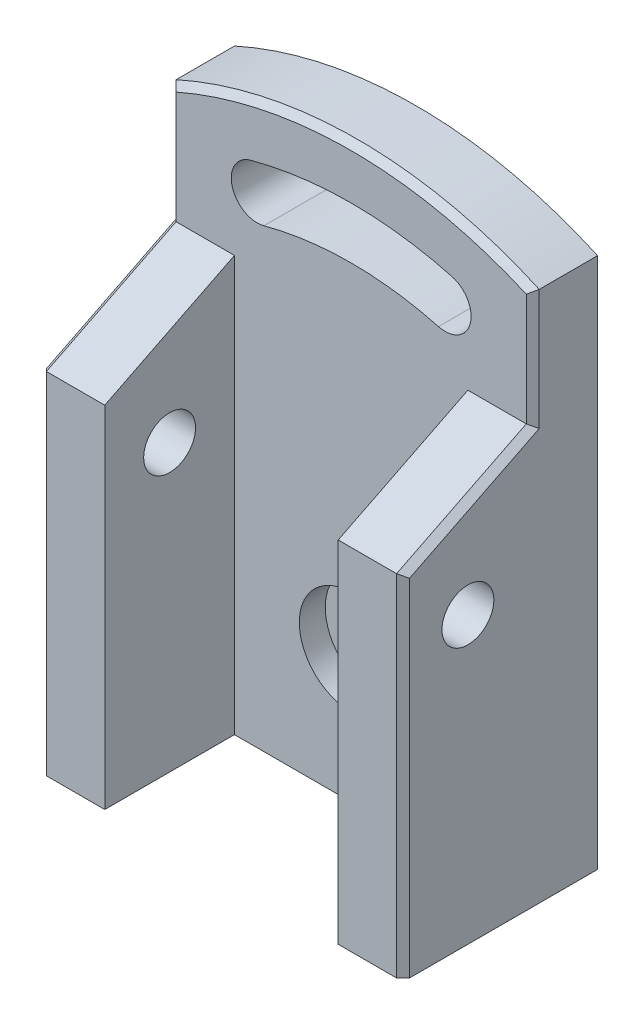
ISO-10303-21;
HEADER;
FILE_DESCRIPTION(('STEP AP214'),'2;1');
FILE_NAME('part.step','',(''),(''),'','','');
FILE_SCHEMA(('AUTOMOTIVE_DESIGN { 1 0 10303 214 1 1 1 1 }'));
ENDSEC;
DATA;
#1=APPLICATION_CONTEXT('core data for automotive mechanical design processes');
#2=APPLICATION_PROTOCOL_DEFINITION('international standard','automotive_design',2000,#1);
#3=PRODUCT_CONTEXT('',#1,'mechanical');
#4=PRODUCT('Part','Part','',(#3));
#5=PRODUCT_RELATED_PRODUCT_CATEGORY('part','',(#4));
#6=PRODUCT_DEFINITION_FORMATION('','',#4);
#7=PRODUCT_DEFINITION_CONTEXT('part definition',#1,'design');
#8=PRODUCT_DEFINITION('design','',#6,#7);
#9=PRODUCT_DEFINITION_SHAPE('','',#8);
#10=(LENGTH_UNIT() NAMED_UNIT(*) SI_UNIT(.MILLI.,.METRE.));
#11=(NAMED_UNIT(*) PLANE_ANGLE_UNIT() SI_UNIT($,.RADIAN.));
#12=(NAMED_UNIT(*) SI_UNIT($,.STERADIAN.) SOLID_ANGLE_UNIT());
#13=UNCERTAINTY_MEASURE_WITH_UNIT(LENGTH_MEASURE(1.E-05),#10,'distance_accuracy_value','');
#14=(GEOMETRIC_REPRESENTATION_CONTEXT(3) GLOBAL_UNCERTAINTY_ASSIGNED_CONTEXT((#13)) GLOBAL_UNIT_ASSIGNED_CONTEXT((#10,
#11,#12)) REPRESENTATION_CONTEXT('',''));
#15=CARTESIAN_POINT('',(0.,0.,0.));
#16=DIRECTION('',(0.,0.,1.));
#17=DIRECTION('',(1.,0.,0.));
#18=AXIS2_PLACEMENT_3D('',#15,#16,#17);
#19=CARTESIAN_POINT('',(0.,0.,0.));
#20=DIRECTION('',(0.,0.,1.));
#21=DIRECTION('',(1.,0.,0.));
#22=AXIS2_PLACEMENT_3D('',#19,#20,#21);
#23=PLANE('',#22);
#24=CARTESIAN_POINT('',(0.,20.,0.));
#25=DIRECTION('',(0.,0.,1.));
#26=DIRECTION('',(1.,0.,0.));
#27=AXIS2_PLACEMENT_3D('',#24,#25,#26);
#28=CIRCLE('',#27,8.00000000000001);
#29=CARTESIAN_POINT('',(8.00000000000001,20.,0.));
#30=VERTEX_POINT('',#29);
#31=EDGE_CURVE('E229',#30,#30,#28,.T.);
#32=ORIENTED_EDGE('',*,*,#31,.F.);
#33=EDGE_LOOP('',(#32));
#34=FACE_BOUND('',#33,.T.);
#35=CARTESIAN_POINT('',(-14.4938665257408,74.0918462721879,0.));
#36=DIRECTION('',(0.,0.,1.));
#37=DIRECTION('',(1.,0.,0.));
#38=AXIS2_PLACEMENT_3D('',#35,#36,#37);
#39=CIRCLE('',#38,3.99999999999999);
#40=CARTESIAN_POINT('',(-15.5291427061509,77.9555495773442,0.));
#41=VERTEX_POINT('',#40);
#42=CARTESIAN_POINT('',(-13.4585903453308,70.2281429670317,0.));
#43=VERTEX_POINT('',#42);
#44=EDGE_CURVE('E258',#41,#43,#39,.T.);
#45=ORIENTED_EDGE('',*,*,#44,.F.);
#46=CARTESIAN_POINT('',(0.,20.,0.));
#47=DIRECTION('',(0.,0.,1.));
#48=DIRECTION('',(1.,0.,0.));
#49=AXIS2_PLACEMENT_3D('',#46,#47,#48);
#50=CIRCLE('',#49,60.);
#51=CARTESIAN_POINT('',(15.5291427061509,77.9555495773442,0.));
#52=VERTEX_POINT('',#51);
#53=EDGE_CURVE('E261',#52,#41,#50,.T.);
#54=ORIENTED_EDGE('',*,*,#53,.F.);
#55=CARTESIAN_POINT('',(14.4938665257408,74.0918462721879,0.));
#56=DIRECTION('',(0.,0.,1.));
#57=DIRECTION('',(1.,0.,0.));
#58=AXIS2_PLACEMENT_3D('',#55,#56,#57);
#59=CIRCLE('',#58,3.99999999999999);
#60=CARTESIAN_POINT('',(13.4585903453308,70.2281429670316,0.));
#61=VERTEX_POINT('',#60);
#62=EDGE_CURVE('E263',#61,#52,#59,.T.);
#63=ORIENTED_EDGE('',*,*,#62,.F.);
#64=CARTESIAN_POINT('',(0.,20.,0.));
#65=DIRECTION('',(0.,0.,1.));
#66=DIRECTION('',(1.,0.,0.));
#67=AXIS2_PLACEMENT_3D('',#64,#65,#66);
#68=CIRCLE('',#67,52.);
#69=EDGE_CURVE('E240',#61,#43,#68,.T.);
#70=ORIENTED_EDGE('',*,*,#69,.T.);
#71=EDGE_LOOP('',(#45,#54,#63,#70));
#72=FACE_BOUND('',#71,.T.);
#73=DIRECTION('',(1.,0.,0.));
#74=VECTOR('',#73,1.);
#75=CARTESIAN_POINT('',(18.,64.,0.));
#76=LINE('',#75,#74);
#77=CARTESIAN_POINT('',(18.,64.,0.));
#78=VERTEX_POINT('',#77);
#79=CARTESIAN_POINT('',(27.,64.,0.));
#80=VERTEX_POINT('',#79);
#81=EDGE_CURVE('E174',#78,#80,#76,.T.);
#82=ORIENTED_EDGE('',*,*,#81,.T.);
#83=DIRECTION('',(0.,1.,0.));
#84=VECTOR('',#83,1.);
#85=CARTESIAN_POINT('',(27.,81.9677335393187,0.));
#86=LINE('',#85,#84);
#87=CARTESIAN_POINT('',(27.,81.3188388670236,0.));
#88=VERTEX_POINT('',#87);
#89=EDGE_CURVE('E306',#80,#88,#86,.T.);
#90=ORIENTED_EDGE('',*,*,#89,.T.);
#91=CARTESIAN_POINT('',(0.,20.,0.));
#92=DIRECTION('',(0.,0.,1.));
#93=DIRECTION('',(1.,0.,0.));
#94=AXIS2_PLACEMENT_3D('',#91,#92,#93);
#95=CIRCLE('',#94,67.);
#96=CARTESIAN_POINT('',(-27.,81.3188388670236,0.));
#97=VERTEX_POINT('',#96);
#98=EDGE_CURVE('E304',#88,#97,#95,.T.);
#99=ORIENTED_EDGE('',*,*,#98,.T.);
#100=DIRECTION('',(0.,-1.,0.));
#101=VECTOR('',#100,1.);
#102=CARTESIAN_POINT('',(-27.,64.,0.));
#103=LINE('',#102,#101);
#104=CARTESIAN_POINT('',(-27.,64.,0.));
#105=VERTEX_POINT('',#104);
#106=EDGE_CURVE('E302',#97,#105,#103,.T.);
#107=ORIENTED_EDGE('',*,*,#106,.T.);
#108=DIRECTION('',(-1.,0.,0.));
#109=VECTOR('',#108,1.);
#110=CARTESIAN_POINT('',(-18.,64.,0.));
#111=LINE('',#110,#109);
#112=CARTESIAN_POINT('',(-18.,64.,0.));
#113=VERTEX_POINT('',#112);
#114=EDGE_CURVE('E219',#113,#105,#111,.T.);
#115=ORIENTED_EDGE('',*,*,#114,.F.);
#116=DIRECTION('',(0.,1.,0.));
#117=VECTOR('',#116,1.);
#118=CARTESIAN_POINT('',(-18.,0.,0.));
#119=LINE('',#118,#117);
#120=CARTESIAN_POINT('',(-18.,0.,0.));
#121=VERTEX_POINT('',#120);
#122=EDGE_CURVE('E204',#121,#113,#119,.T.);
#123=ORIENTED_EDGE('',*,*,#122,.F.);
#124=DIRECTION('',(1.,0.,0.));
#125=VECTOR('',#124,1.);
#126=CARTESIAN_POINT('',(0.,0.,0.));
#127=LINE('',#126,#125);
#128=CARTESIAN_POINT('',(18.,0.,0.));
#129=VERTEX_POINT('',#128);
#130=EDGE_CURVE('E233',#121,#129,#127,.T.);
#131=ORIENTED_EDGE('',*,*,#130,.T.);
#132=DIRECTION('',(0.,-1.,0.));
#133=VECTOR('',#132,1.);
#134=CARTESIAN_POINT('',(18.,0.,0.));
#135=LINE('',#134,#133);
#136=EDGE_CURVE('E188',#78,#129,#135,.T.);
#137=ORIENTED_EDGE('',*,*,#136,.F.);
#138=EDGE_LOOP('',(#82,#90,#99,#107,#115,#123,#131,#137));
#139=FACE_BOUND('',#138,.T.);
#140=ADVANCED_FACE('F35',(#34,#72,#139),#23,.T.);
#141=CARTESIAN_POINT('',(-14.4938665257408,74.0918462721879,-10.));
#142=DIRECTION('',(0.,0.,1.));
#143=DIRECTION('',(1.,0.,0.));
#144=AXIS2_PLACEMENT_3D('',#141,#142,#143);
#145=CYLINDRICAL_SURFACE('',#144,3.99999999999999);
#146=ORIENTED_EDGE('',*,*,#44,.T.);
#147=DIRECTION('',(0.,0.,1.));
#148=VECTOR('',#147,1.);
#149=CARTESIAN_POINT('',(-13.4585903453308,70.2281429670317,-10.));
#150=LINE('',#149,#148);
#151=CARTESIAN_POINT('',(-13.4585903453308,70.2281429670317,-10.));
#152=VERTEX_POINT('',#151);
#153=EDGE_CURVE('E267',#152,#43,#150,.T.);
#154=ORIENTED_EDGE('',*,*,#153,.F.);
#155=CARTESIAN_POINT('',(-14.4938665257408,74.0918462721879,-10.));
#156=DIRECTION('',(0.,0.,1.));
#157=DIRECTION('',(1.,0.,0.));
#158=AXIS2_PLACEMENT_3D('',#155,#156,#157);
#159=CIRCLE('',#158,3.99999999999999);
#160=CARTESIAN_POINT('',(-15.5291427061509,77.9555495773442,-10.));
#161=VERTEX_POINT('',#160);
#162=EDGE_CURVE('E247',#161,#152,#159,.T.);
#163=ORIENTED_EDGE('',*,*,#162,.F.);
#164=DIRECTION('',(0.,0.,1.));
#165=VECTOR('',#164,1.);
#166=CARTESIAN_POINT('',(-15.5291427061509,77.9555495773442,-10.));
#167=LINE('',#166,#165);
#168=EDGE_CURVE('E275',#161,#41,#167,.T.);
#169=ORIENTED_EDGE('',*,*,#168,.T.);
#170=EDGE_LOOP('',(#146,#154,#163,#169));
#171=FACE_BOUND('',#170,.T.);
#172=ADVANCED_FACE('F357',(#171),#145,.F.);
#173=CARTESIAN_POINT('',(0.,20.,-10.));
#174=DIRECTION('',(0.,0.,1.));
#175=DIRECTION('',(1.,0.,0.));
#176=AXIS2_PLACEMENT_3D('',#173,#174,#175);
#177=CYLINDRICAL_SURFACE('',#176,52.);
#178=ORIENTED_EDGE('',*,*,#69,.F.);
#179=DIRECTION('',(0.,0.,1.));
#180=VECTOR('',#179,1.);
#181=CARTESIAN_POINT('',(13.4585903453308,70.2281429670316,-10.));
#182=LINE('',#181,#180);
#183=CARTESIAN_POINT('',(13.4585903453308,70.2281429670316,-10.));
#184=VERTEX_POINT('',#183);
#185=EDGE_CURVE('E270',#184,#61,#182,.T.);
#186=ORIENTED_EDGE('',*,*,#185,.F.);
#187=CARTESIAN_POINT('',(0.,20.,-10.));
#188=DIRECTION('',(0.,0.,1.));
#189=DIRECTION('',(1.,0.,0.));
#190=AXIS2_PLACEMENT_3D('',#187,#188,#189);
#191=CIRCLE('',#190,52.);
#192=EDGE_CURVE('E253',#184,#152,#191,.T.);
#193=ORIENTED_EDGE('',*,*,#192,.T.);
#194=ORIENTED_EDGE('',*,*,#153,.T.);
#195=EDGE_LOOP('',(#178,#186,#193,#194));
#196=FACE_BOUND('',#195,.T.);
#197=ADVANCED_FACE('F363',(#196),#177,.T.);
#198=CARTESIAN_POINT('',(14.4938665257408,74.0918462721879,-10.));
#199=DIRECTION('',(0.,0.,1.));
#200=DIRECTION('',(1.,0.,0.));
#201=AXIS2_PLACEMENT_3D('',#198,#199,#200);
#202=CYLINDRICAL_SURFACE('',#201,3.99999999999999);
#203=ORIENTED_EDGE('',*,*,#62,.T.);
#204=DIRECTION('',(0.,0.,1.));
#205=VECTOR('',#204,1.);
#206=CARTESIAN_POINT('',(15.5291427061509,77.9555495773442,-10.));
#207=LINE('',#206,#205);
#208=CARTESIAN_POINT('',(15.5291427061509,77.9555495773442,-10.));
#209=VERTEX_POINT('',#208);
#210=EDGE_CURVE('E272',#209,#52,#207,.T.);
#211=ORIENTED_EDGE('',*,*,#210,.F.);
#212=CARTESIAN_POINT('',(14.4938665257408,74.0918462721879,-10.));
#213=DIRECTION('',(0.,0.,1.));
#214=DIRECTION('',(1.,0.,0.));
#215=AXIS2_PLACEMENT_3D('',#212,#213,#214);
#216=CIRCLE('',#215,3.99999999999999);
#217=EDGE_CURVE('E251',#184,#209,#216,.T.);
#218=ORIENTED_EDGE('',*,*,#217,.F.);
#219=ORIENTED_EDGE('',*,*,#185,.T.);
#220=EDGE_LOOP('',(#203,#211,#218,#219));
#221=FACE_BOUND('',#220,.T.);
#222=ADVANCED_FACE('F374',(#221),#202,.F.);
#223=CARTESIAN_POINT('',(0.,20.,-10.));
#224=DIRECTION('',(0.,0.,1.));
#225=DIRECTION('',(1.,0.,0.));
#226=AXIS2_PLACEMENT_3D('',#223,#224,#225);
#227=CYLINDRICAL_SURFACE('',#226,68.);
#228=DIRECTION('',(0.,0.,1.));
#229=VECTOR('',#228,1.);
#230=CARTESIAN_POINT('',(-28.,81.9677335393187,-10.));
#231=LINE('',#230,#229);
#232=CARTESIAN_POINT('',(-28.,81.9677335393187,-10.));
#233=VERTEX_POINT('',#232);
#234=CARTESIAN_POINT('',(-28.,81.9677335393187,-1.00000000000001));
#235=VERTEX_POINT('',#234);
#236=EDGE_CURVE('E256',#233,#235,#231,.T.);
#237=ORIENTED_EDGE('',*,*,#236,.T.);
#238=CARTESIAN_POINT('',(0.,20.,-1.00000000000001));
#239=DIRECTION('',(0.,0.,1.));
#240=DIRECTION('',(1.,0.,0.));
#241=AXIS2_PLACEMENT_3D('',#238,#239,#240);
#242=CIRCLE('',#241,68.);
#243=CARTESIAN_POINT('',(28.,81.9677335393187,-1.00000000000001));
#244=VERTEX_POINT('',#243);
#245=EDGE_CURVE('E308',#235,#244,#242,.F.);
#246=ORIENTED_EDGE('',*,*,#245,.T.);
#247=DIRECTION('',(0.,0.,1.));
#248=VECTOR('',#247,1.);
#249=CARTESIAN_POINT('',(28.,81.9677335393187,-10.));
#250=LINE('',#249,#248);
#251=CARTESIAN_POINT('',(28.,81.9677335393187,-10.));
#252=VERTEX_POINT('',#251);
#253=EDGE_CURVE('E278',#252,#244,#250,.T.);
#254=ORIENTED_EDGE('',*,*,#253,.F.);
#255=CARTESIAN_POINT('',(0.,20.,-10.));
#256=DIRECTION('',(0.,0.,1.));
#257=DIRECTION('',(1.,0.,0.));
#258=AXIS2_PLACEMENT_3D('',#255,#256,#257);
#259=CIRCLE('',#258,68.);
#260=EDGE_CURVE('E236',#233,#252,#259,.F.);
#261=ORIENTED_EDGE('',*,*,#260,.F.);
#262=EDGE_LOOP('',(#237,#246,#254,#261));
#263=FACE_BOUND('',#262,.T.);
#264=ADVANCED_FACE('F378',(#263),#227,.T.);
#265=CARTESIAN_POINT('',(28.,0.,-10.));
#266=DIRECTION('',(-1.,0.,0.));
#267=DIRECTION('',(0.,-1.,0.));
#268=AXIS2_PLACEMENT_3D('',#265,#266,#267);
#269=PLANE('',#268);
#270=DIRECTION('',(0.,-0.447213595499958,0.894427190999916));
#271=VECTOR('',#270,1.);
#272=CARTESIAN_POINT('',(28.,54.3055728090001,17.1527864045));
#273=LINE('',#272,#271);
#274=CARTESIAN_POINT('',(28.,63.3819660112501,-1.00000000000001));
#275=VERTEX_POINT('',#274);
#276=CARTESIAN_POINT('',(28.,53.3819660112501,19.));
#277=VERTEX_POINT('',#276);
#278=EDGE_CURVE('E293',#275,#277,#273,.T.);
#279=ORIENTED_EDGE('',*,*,#278,.T.);
#280=DIRECTION('',(0.,-1.,0.));
#281=VECTOR('',#280,1.);
#282=CARTESIAN_POINT('',(28.,0.,19.));
#283=LINE('',#282,#281);
#284=CARTESIAN_POINT('',(28.,0.,19.));
#285=VERTEX_POINT('',#284);
#286=EDGE_CURVE('E295',#277,#285,#283,.T.);
#287=ORIENTED_EDGE('',*,*,#286,.T.);
#288=DIRECTION('',(0.,0.,1.));
#289=VECTOR('',#288,1.);
#290=CARTESIAN_POINT('',(28.,0.,-10.));
#291=LINE('',#290,#289);
#292=CARTESIAN_POINT('',(28.,0.,-10.));
#293=VERTEX_POINT('',#292);
#294=EDGE_CURVE('E281',#293,#285,#291,.T.);
#295=ORIENTED_EDGE('',*,*,#294,.F.);
#296=DIRECTION('',(0.,-1.,0.));
#297=VECTOR('',#296,1.);
#298=CARTESIAN_POINT('',(28.,0.,-10.));
#299=LINE('',#298,#297);
#300=EDGE_CURVE('E245',#252,#293,#299,.T.);
#301=ORIENTED_EDGE('',*,*,#300,.F.);
#302=ORIENTED_EDGE('',*,*,#253,.T.);
#303=DIRECTION('',(0.,-1.,0.));
#304=VECTOR('',#303,1.);
#305=CARTESIAN_POINT('',(28.,64.,-1.00000000000001));
#306=LINE('',#305,#304);
#307=EDGE_CURVE('E291',#244,#275,#306,.T.);
#308=ORIENTED_EDGE('',*,*,#307,.T.);
#309=EDGE_LOOP('',(#279,#287,#295,#301,#302,#308));
#310=FACE_BOUND('',#309,.T.);
#311=CARTESIAN_POINT('',(28.,44.,10.));
#312=DIRECTION('',(1.,0.,0.));
#313=DIRECTION('',(0.,1.,0.));
#314=AXIS2_PLACEMENT_3D('',#311,#312,#313);
#315=CIRCLE('',#314,4.);
#316=CARTESIAN_POINT('',(28.,48.,10.));
#317=VERTEX_POINT('',#316);
#318=EDGE_CURVE('E194',#317,#317,#315,.T.);
#319=ORIENTED_EDGE('',*,*,#318,.F.);
#320=EDGE_LOOP('',(#319));
#321=FACE_BOUND('',#320,.T.);
#322=ADVANCED_FACE('F385',(#310,#321),#269,.F.);
#323=CARTESIAN_POINT('',(0.,0.,-10.));
#324=DIRECTION('',(0.,-1.,0.));
#325=DIRECTION('',(1.,0.,0.));
#326=AXIS2_PLACEMENT_3D('',#323,#324,#325);
#327=PLANE('',#326);
#328=ORIENTED_EDGE('',*,*,#294,.T.);
#329=DIRECTION('',(0.707106781186548,0.,-0.707106781186548));
#330=VECTOR('',#329,1.);
#331=CARTESIAN_POINT('',(28.5,0.,18.5));
#332=LINE('',#331,#330);
#333=CARTESIAN_POINT('',(27.,0.,20.));
#334=VERTEX_POINT('',#333);
#335=EDGE_CURVE('E170',#285,#334,#332,.F.);
#336=ORIENTED_EDGE('',*,*,#335,.T.);
#337=DIRECTION('',(1.,0.,0.));
#338=VECTOR('',#337,1.);
#339=CARTESIAN_POINT('',(18.,0.,20.));
#340=LINE('',#339,#338);
#341=CARTESIAN_POINT('',(18.,0.,20.));
#342=VERTEX_POINT('',#341);
#343=EDGE_CURVE('E161',#342,#334,#340,.T.);
#344=ORIENTED_EDGE('',*,*,#343,.F.);
#345=DIRECTION('',(0.,0.,-1.));
#346=VECTOR('',#345,1.);
#347=CARTESIAN_POINT('',(18.,0.,0.));
#348=LINE('',#347,#346);
#349=EDGE_CURVE('E167',#342,#129,#348,.T.);
#350=ORIENTED_EDGE('',*,*,#349,.T.);
#351=ORIENTED_EDGE('',*,*,#130,.F.);
#352=DIRECTION('',(0.,0.,1.));
#353=VECTOR('',#352,1.);
#354=CARTESIAN_POINT('',(-18.,0.,0.));
#355=LINE('',#354,#353);
#356=CARTESIAN_POINT('',(-18.,0.,20.));
#357=VERTEX_POINT('',#356);
#358=EDGE_CURVE('E207',#121,#357,#355,.T.);
#359=ORIENTED_EDGE('',*,*,#358,.T.);
#360=DIRECTION('',(-1.,0.,0.));
#361=VECTOR('',#360,1.);
#362=CARTESIAN_POINT('',(-18.,0.,20.));
#363=LINE('',#362,#361);
#364=CARTESIAN_POINT('',(-27.,0.,20.));
#365=VERTEX_POINT('',#364);
#366=EDGE_CURVE('E216',#357,#365,#363,.T.);
#367=ORIENTED_EDGE('',*,*,#366,.T.);
#368=DIRECTION('',(-0.707106781186548,0.,-0.707106781186548));
#369=VECTOR('',#368,1.);
#370=CARTESIAN_POINT('',(-28.5,0.,18.5));
#371=LINE('',#370,#369);
#372=CARTESIAN_POINT('',(-28.,0.,19.));
#373=VERTEX_POINT('',#372);
#374=EDGE_CURVE('E297',#365,#373,#371,.T.);
#375=ORIENTED_EDGE('',*,*,#374,.T.);
#376=DIRECTION('',(0.,0.,1.));
#377=VECTOR('',#376,1.);
#378=CARTESIAN_POINT('',(-28.,0.,-10.));
#379=LINE('',#378,#377);
#380=CARTESIAN_POINT('',(-28.,0.,-10.));
#381=VERTEX_POINT('',#380);
#382=EDGE_CURVE('E283',#381,#373,#379,.T.);
#383=ORIENTED_EDGE('',*,*,#382,.F.);
#384=DIRECTION('',(1.,0.,0.));
#385=VECTOR('',#384,1.);
#386=CARTESIAN_POINT('',(0.,0.,-10.));
#387=LINE('',#386,#385);
#388=EDGE_CURVE('E242',#381,#293,#387,.T.);
#389=ORIENTED_EDGE('',*,*,#388,.T.);
#390=EDGE_LOOP('',(#328,#336,#344,#350,#351,#359,#367,#375,#383,#389));
#391=FACE_BOUND('',#390,.T.);
#392=ADVANCED_FACE('F164',(#391),#327,.T.);
#393=CARTESIAN_POINT('',(-28.,0.,-10.));
#394=DIRECTION('',(1.,0.,0.));
#395=DIRECTION('',(0.,1.,0.));
#396=AXIS2_PLACEMENT_3D('',#393,#394,#395);
#397=PLANE('',#396);
#398=DIRECTION('',(0.,0.447213595499958,-0.894427190999916));
#399=VECTOR('',#398,1.);
#400=CARTESIAN_POINT('',(-28.,63.1055728090001,-0.447213595499967));
#401=LINE('',#400,#399);
#402=CARTESIAN_POINT('',(-28.,53.3819660112501,19.));
#403=VERTEX_POINT('',#402);
#404=CARTESIAN_POINT('',(-28.,63.3819660112501,-1.00000000000001));
#405=VERTEX_POINT('',#404);
#406=EDGE_CURVE('E59',#403,#405,#401,.T.);
#407=ORIENTED_EDGE('',*,*,#406,.T.);
#408=DIRECTION('',(0.,1.,0.));
#409=VECTOR('',#408,1.);
#410=CARTESIAN_POINT('',(-28.,81.9677335393187,-1.00000000000001));
#411=LINE('',#410,#409);
#412=EDGE_CURVE('E313',#405,#235,#411,.T.);
#413=ORIENTED_EDGE('',*,*,#412,.T.);
#414=ORIENTED_EDGE('',*,*,#236,.F.);
#415=DIRECTION('',(0.,1.,0.));
#416=VECTOR('',#415,1.);
#417=CARTESIAN_POINT('',(-28.,0.,-10.));
#418=LINE('',#417,#416);
#419=EDGE_CURVE('E239',#381,#233,#418,.T.);
#420=ORIENTED_EDGE('',*,*,#419,.F.);
#421=ORIENTED_EDGE('',*,*,#382,.T.);
#422=DIRECTION('',(0.,1.,0.));
#423=VECTOR('',#422,1.);
#424=CARTESIAN_POINT('',(-28.,54.,19.));
#425=LINE('',#424,#423);
#426=EDGE_CURVE('E310',#373,#403,#425,.T.);
#427=ORIENTED_EDGE('',*,*,#426,.T.);
#428=EDGE_LOOP('',(#407,#413,#414,#420,#421,#427));
#429=FACE_BOUND('',#428,.T.);
#430=CARTESIAN_POINT('',(-28.,44.,10.));
#431=DIRECTION('',(-1.,0.,0.));
#432=DIRECTION('',(0.,-1.,0.));
#433=AXIS2_PLACEMENT_3D('',#430,#431,#432);
#434=CIRCLE('',#433,4.);
#435=CARTESIAN_POINT('',(-28.,40.,10.));
#436=VERTEX_POINT('',#435);
#437=EDGE_CURVE('E198',#436,#436,#434,.T.);
#438=ORIENTED_EDGE('',*,*,#437,.F.);
#439=EDGE_LOOP('',(#438));
#440=FACE_BOUND('',#439,.T.);
#441=ADVANCED_FACE('F382',(#429,#440),#397,.F.);
#442=CARTESIAN_POINT('',(0.,20.,-10.));
#443=DIRECTION('',(0.,0.,1.));
#444=DIRECTION('',(1.,0.,0.));
#445=AXIS2_PLACEMENT_3D('',#442,#443,#444);
#446=CYLINDRICAL_SURFACE('',#445,60.);
#447=ORIENTED_EDGE('',*,*,#53,.T.);
#448=ORIENTED_EDGE('',*,*,#168,.F.);
#449=CARTESIAN_POINT('',(0.,20.,-10.));
#450=DIRECTION('',(0.,0.,1.));
#451=DIRECTION('',(1.,0.,0.));
#452=AXIS2_PLACEMENT_3D('',#449,#450,#451);
#453=CIRCLE('',#452,60.);
#454=EDGE_CURVE('E249',#209,#161,#453,.T.);
#455=ORIENTED_EDGE('',*,*,#454,.F.);
#456=ORIENTED_EDGE('',*,*,#210,.T.);
#457=EDGE_LOOP('',(#447,#448,#455,#456));
#458=FACE_BOUND('',#457,.T.);
#459=ADVANCED_FACE('F380',(#458),#446,.F.);
#460=CARTESIAN_POINT('',(0.,0.,-10.));
#461=DIRECTION('',(0.,0.,1.));
#462=DIRECTION('',(1.,0.,0.));
#463=AXIS2_PLACEMENT_3D('',#460,#461,#462);
#464=PLANE('',#463);
#465=CARTESIAN_POINT('',(0.,20.,-10.));
#466=DIRECTION('',(0.,0.,1.));
#467=DIRECTION('',(1.,0.,0.));
#468=AXIS2_PLACEMENT_3D('',#465,#466,#467);
#469=CIRCLE('',#468,4.00000000000001);
#470=CARTESIAN_POINT('',(4.00000000000001,20.,-10.));
#471=VERTEX_POINT('',#470);
#472=EDGE_CURVE('E226',#471,#471,#469,.T.);
#473=ORIENTED_EDGE('',*,*,#472,.T.);
#474=EDGE_LOOP('',(#473));
#475=FACE_BOUND('',#474,.T.);
#476=ORIENTED_EDGE('',*,*,#260,.T.);
#477=ORIENTED_EDGE('',*,*,#300,.T.);
#478=ORIENTED_EDGE('',*,*,#388,.F.);
#479=ORIENTED_EDGE('',*,*,#419,.T.);
#480=EDGE_LOOP('',(#476,#477,#478,#479));
#481=FACE_BOUND('',#480,.T.);
#482=ORIENTED_EDGE('',*,*,#162,.T.);
#483=ORIENTED_EDGE('',*,*,#192,.F.);
#484=ORIENTED_EDGE('',*,*,#217,.T.);
#485=ORIENTED_EDGE('',*,*,#454,.T.);
#486=EDGE_LOOP('',(#482,#483,#484,#485));
#487=FACE_BOUND('',#486,.T.);
#488=ADVANCED_FACE('F370',(#475,#481,#487),#464,.F.);
#489=CARTESIAN_POINT('',(0.,20.,-4.));
#490=DIRECTION('',(0.,0.,1.));
#491=DIRECTION('',(1.,0.,0.));
#492=AXIS2_PLACEMENT_3D('',#489,#490,#491);
#493=CYLINDRICAL_SURFACE('',#492,8.00000000000001);
#494=CARTESIAN_POINT('',(0.,20.,-4.));
#495=DIRECTION('',(0.,0.,1.));
#496=DIRECTION('',(1.,0.,0.));
#497=AXIS2_PLACEMENT_3D('',#494,#495,#496);
#498=CIRCLE('',#497,8.00000000000001);
#499=CARTESIAN_POINT('',(8.00000000000001,20.,-4.));
#500=VERTEX_POINT('',#499);
#501=EDGE_CURVE('E230',#500,#500,#498,.T.);
#502=ORIENTED_EDGE('',*,*,#501,.F.);
#503=EDGE_LOOP('',(#502));
#504=FACE_BOUND('',#503,.T.);
#505=ORIENTED_EDGE('',*,*,#31,.T.);
#506=EDGE_LOOP('',(#505));
#507=FACE_BOUND('',#506,.T.);
#508=ADVANCED_FACE('F452',(#504,#507),#493,.F.);
#509=CARTESIAN_POINT('',(0.,20.,-4.));
#510=DIRECTION('',(0.,0.,1.));
#511=DIRECTION('',(1.,0.,0.));
#512=AXIS2_PLACEMENT_3D('',#509,#510,#511);
#513=PLANE('',#512);
#514=CARTESIAN_POINT('',(0.,20.,-4.));
#515=DIRECTION('',(0.,0.,1.));
#516=DIRECTION('',(1.,0.,0.));
#517=AXIS2_PLACEMENT_3D('',#514,#515,#516);
#518=CIRCLE('',#517,4.00000000000001);
#519=CARTESIAN_POINT('',(4.00000000000001,20.,-4.));
#520=VERTEX_POINT('',#519);
#521=EDGE_CURVE('E221',#520,#520,#518,.T.);
#522=ORIENTED_EDGE('',*,*,#521,.F.);
#523=EDGE_LOOP('',(#522));
#524=FACE_BOUND('',#523,.T.);
#525=ORIENTED_EDGE('',*,*,#501,.T.);
#526=EDGE_LOOP('',(#525));
#527=FACE_BOUND('',#526,.T.);
#528=ADVANCED_FACE('F442',(#524,#527),#513,.T.);
#529=CARTESIAN_POINT('',(0.,20.,-24.));
#530=DIRECTION('',(0.,0.,1.));
#531=DIRECTION('',(1.,0.,0.));
#532=AXIS2_PLACEMENT_3D('',#529,#530,#531);
#533=CYLINDRICAL_SURFACE('',#532,4.00000000000001);
#534=ORIENTED_EDGE('',*,*,#521,.T.);
#535=EDGE_LOOP('',(#534));
#536=FACE_BOUND('',#535,.T.);
#537=ORIENTED_EDGE('',*,*,#472,.F.);
#538=EDGE_LOOP('',(#537));
#539=FACE_BOUND('',#538,.T.);
#540=ADVANCED_FACE('F434',(#536,#539),#533,.F.);
#541=CARTESIAN_POINT('',(-18.,51.2,25.6));
#542=DIRECTION('',(0.,0.894427190999916,0.447213595499958));
#543=DIRECTION('',(0.,-0.447213595499958,0.894427190999916));
#544=AXIS2_PLACEMENT_3D('',#541,#542,#543);
#545=PLANE('',#544);
#546=ORIENTED_EDGE('',*,*,#114,.T.);
#547=DIRECTION('',(0.,-0.447213595499958,0.894427190999916));
#548=VECTOR('',#547,1.);
#549=CARTESIAN_POINT('',(-27.,54.,20.));
#550=LINE('',#549,#548);
#551=CARTESIAN_POINT('',(-27.,54.,20.));
#552=VERTEX_POINT('',#551);
#553=EDGE_CURVE('E44',#105,#552,#550,.T.);
#554=ORIENTED_EDGE('',*,*,#553,.T.);
#555=DIRECTION('',(-1.,0.,0.));
#556=VECTOR('',#555,1.);
#557=CARTESIAN_POINT('',(-18.,54.,20.));
#558=LINE('',#557,#556);
#559=CARTESIAN_POINT('',(-18.,54.,20.));
#560=VERTEX_POINT('',#559);
#561=EDGE_CURVE('E222',#560,#552,#558,.T.);
#562=ORIENTED_EDGE('',*,*,#561,.F.);
#563=DIRECTION('',(0.,0.447213595499958,-0.894427190999916));
#564=VECTOR('',#563,1.);
#565=CARTESIAN_POINT('',(-18.,51.2,25.6));
#566=LINE('',#565,#564);
#567=EDGE_CURVE('E213',#560,#113,#566,.T.);
#568=ORIENTED_EDGE('',*,*,#567,.T.);
#569=EDGE_LOOP('',(#546,#554,#562,#568));
#570=FACE_BOUND('',#569,.T.);
#571=ADVANCED_FACE('F432',(#570),#545,.T.);
#572=CARTESIAN_POINT('',(-18.,0.,20.));
#573=DIRECTION('',(0.,0.,1.));
#574=DIRECTION('',(1.,0.,0.));
#575=AXIS2_PLACEMENT_3D('',#572,#573,#574);
#576=PLANE('',#575);
#577=ORIENTED_EDGE('',*,*,#561,.T.);
#578=DIRECTION('',(0.,-1.,0.));
#579=VECTOR('',#578,1.);
#580=CARTESIAN_POINT('',(-27.,0.,20.));
#581=LINE('',#580,#579);
#582=EDGE_CURVE('E11',#552,#365,#581,.T.);
#583=ORIENTED_EDGE('',*,*,#582,.T.);
#584=ORIENTED_EDGE('',*,*,#366,.F.);
#585=DIRECTION('',(0.,1.,0.));
#586=VECTOR('',#585,1.);
#587=CARTESIAN_POINT('',(-18.,0.,20.));
#588=LINE('',#587,#586);
#589=EDGE_CURVE('E210',#357,#560,#588,.T.);
#590=ORIENTED_EDGE('',*,*,#589,.T.);
#591=EDGE_LOOP('',(#577,#583,#584,#590));
#592=FACE_BOUND('',#591,.T.);
#593=ADVANCED_FACE('F426',(#592),#576,.T.);
#594=CARTESIAN_POINT('',(-18.,44.,10.));
#595=DIRECTION('',(-1.,0.,0.));
#596=DIRECTION('',(0.,-1.,0.));
#597=AXIS2_PLACEMENT_3D('',#594,#595,#596);
#598=CYLINDRICAL_SURFACE('',#597,4.);
#599=CARTESIAN_POINT('',(-18.,44.,10.));
#600=DIRECTION('',(-1.,0.,0.));
#601=DIRECTION('',(0.,-1.,0.));
#602=AXIS2_PLACEMENT_3D('',#599,#600,#601);
#603=CIRCLE('',#602,4.);
#604=CARTESIAN_POINT('',(-18.,40.,10.));
#605=VERTEX_POINT('',#604);
#606=EDGE_CURVE('E201',#605,#605,#603,.T.);
#607=ORIENTED_EDGE('',*,*,#606,.F.);
#608=EDGE_LOOP('',(#607));
#609=FACE_BOUND('',#608,.T.);
#610=ORIENTED_EDGE('',*,*,#437,.T.);
#611=EDGE_LOOP('',(#610));
#612=FACE_BOUND('',#611,.T.);
#613=ADVANCED_FACE('F440',(#609,#612),#598,.F.);
#614=CARTESIAN_POINT('',(-18.,0.,0.));
#615=DIRECTION('',(-1.,0.,0.));
#616=DIRECTION('',(0.,-1.,0.));
#617=AXIS2_PLACEMENT_3D('',#614,#615,#616);
#618=PLANE('',#617);
#619=ORIENTED_EDGE('',*,*,#606,.T.);
#620=EDGE_LOOP('',(#619));
#621=FACE_BOUND('',#620,.T.);
#622=ORIENTED_EDGE('',*,*,#122,.T.);
#623=ORIENTED_EDGE('',*,*,#567,.F.);
#624=ORIENTED_EDGE('',*,*,#589,.F.);
#625=ORIENTED_EDGE('',*,*,#358,.F.);
#626=EDGE_LOOP('',(#622,#623,#624,#625));
#627=FACE_BOUND('',#626,.T.);
#628=ADVANCED_FACE('F430',(#621,#627),#618,.F.);
#629=CARTESIAN_POINT('',(18.,0.,20.));
#630=DIRECTION('',(0.,0.,-1.));
#631=DIRECTION('',(-1.,0.,0.));
#632=AXIS2_PLACEMENT_3D('',#629,#630,#631);
#633=PLANE('',#632);
#634=ORIENTED_EDGE('',*,*,#343,.T.);
#635=DIRECTION('',(0.,1.,0.));
#636=VECTOR('',#635,1.);
#637=CARTESIAN_POINT('',(27.,0.,20.));
#638=LINE('',#637,#636);
#639=CARTESIAN_POINT('',(27.,54.,20.));
#640=VERTEX_POINT('',#639);
#641=EDGE_CURVE('E269',#334,#640,#638,.T.);
#642=ORIENTED_EDGE('',*,*,#641,.T.);
#643=DIRECTION('',(1.,0.,0.));
#644=VECTOR('',#643,1.);
#645=CARTESIAN_POINT('',(18.,54.,20.));
#646=LINE('',#645,#644);
#647=CARTESIAN_POINT('',(18.,54.,20.));
#648=VERTEX_POINT('',#647);
#649=EDGE_CURVE('E182',#648,#640,#646,.T.);
#650=ORIENTED_EDGE('',*,*,#649,.F.);
#651=DIRECTION('',(0.,1.,0.));
#652=VECTOR('',#651,1.);
#653=CARTESIAN_POINT('',(18.,0.,20.));
#654=LINE('',#653,#652);
#655=EDGE_CURVE('E179',#342,#648,#654,.T.);
#656=ORIENTED_EDGE('',*,*,#655,.F.);
#657=EDGE_LOOP('',(#634,#642,#650,#656));
#658=FACE_BOUND('',#657,.T.);
#659=ADVANCED_FACE('F180',(#658),#633,.F.);
#660=CARTESIAN_POINT('',(18.,51.2,25.6));
#661=DIRECTION('',(0.,-0.894427190999916,-0.447213595499958));
#662=DIRECTION('',(0.,0.447213595499958,-0.894427190999916));
#663=AXIS2_PLACEMENT_3D('',#660,#661,#662);
#664=PLANE('',#663);
#665=ORIENTED_EDGE('',*,*,#649,.T.);
#666=DIRECTION('',(0.,0.447213595499958,-0.894427190999916));
#667=VECTOR('',#666,1.);
#668=CARTESIAN_POINT('',(27.,51.2,25.6));
#669=LINE('',#668,#667);
#670=EDGE_CURVE('E300',#640,#80,#669,.T.);
#671=ORIENTED_EDGE('',*,*,#670,.T.);
#672=ORIENTED_EDGE('',*,*,#81,.F.);
#673=DIRECTION('',(0.,0.447213595499958,-0.894427190999916));
#674=VECTOR('',#673,1.);
#675=CARTESIAN_POINT('',(18.,51.2,25.6));
#676=LINE('',#675,#674);
#677=EDGE_CURVE('E175',#648,#78,#676,.T.);
#678=ORIENTED_EDGE('',*,*,#677,.F.);
#679=EDGE_LOOP('',(#665,#671,#672,#678));
#680=FACE_BOUND('',#679,.T.);
#681=ADVANCED_FACE('F491',(#680),#664,.F.);
#682=CARTESIAN_POINT('',(18.,44.,10.));
#683=DIRECTION('',(1.,0.,0.));
#684=DIRECTION('',(0.,1.,0.));
#685=AXIS2_PLACEMENT_3D('',#682,#683,#684);
#686=CYLINDRICAL_SURFACE('',#685,4.);
#687=CARTESIAN_POINT('',(18.,44.,10.));
#688=DIRECTION('',(1.,0.,0.));
#689=DIRECTION('',(0.,1.,0.));
#690=AXIS2_PLACEMENT_3D('',#687,#688,#689);
#691=CIRCLE('',#690,4.);
#692=CARTESIAN_POINT('',(18.,48.,10.));
#693=VERTEX_POINT('',#692);
#694=EDGE_CURVE('E184',#693,#693,#691,.T.);
#695=ORIENTED_EDGE('',*,*,#694,.F.);
#696=EDGE_LOOP('',(#695));
#697=FACE_BOUND('',#696,.T.);
#698=ORIENTED_EDGE('',*,*,#318,.T.);
#699=EDGE_LOOP('',(#698));
#700=FACE_BOUND('',#699,.T.);
#701=ADVANCED_FACE('F493',(#697,#700),#686,.F.);
#702=CARTESIAN_POINT('',(18.,0.,0.));
#703=DIRECTION('',(1.,0.,0.));
#704=DIRECTION('',(0.,1.,0.));
#705=AXIS2_PLACEMENT_3D('',#702,#703,#704);
#706=PLANE('',#705);
#707=ORIENTED_EDGE('',*,*,#694,.T.);
#708=EDGE_LOOP('',(#707));
#709=FACE_BOUND('',#708,.T.);
#710=ORIENTED_EDGE('',*,*,#655,.T.);
#711=ORIENTED_EDGE('',*,*,#677,.T.);
#712=ORIENTED_EDGE('',*,*,#136,.T.);
#713=ORIENTED_EDGE('',*,*,#349,.F.);
#714=EDGE_LOOP('',(#710,#711,#712,#713));
#715=FACE_BOUND('',#714,.T.);
#716=ADVANCED_FACE('F186',(#709,#715),#706,.F.);
#717=CARTESIAN_POINT('',(-28.,0.,19.));
#718=DIRECTION('',(-0.707106781186547,0.,0.707106781186547));
#719=DIRECTION('',(0.,-1.,0.));
#720=AXIS2_PLACEMENT_3D('',#717,#718,#719);
#721=PLANE('',#720);
#722=ORIENTED_EDGE('',*,*,#374,.F.);
#723=ORIENTED_EDGE('',*,*,#582,.F.);
#724=DIRECTION('',(-0.647936163294299,-0.400446571456078,-0.647936163294299));
#725=VECTOR('',#724,1.);
#726=CARTESIAN_POINT('',(-41.8506885595439,44.8217697138627,5.1493114404561));
#727=LINE('',#726,#725);
#728=EDGE_CURVE('E39',#403,#552,#727,.F.);
#729=ORIENTED_EDGE('',*,*,#728,.F.);
#730=ORIENTED_EDGE('',*,*,#426,.F.);
#731=EDGE_LOOP('',(#722,#723,#729,#730));
#732=FACE_BOUND('',#731,.T.);
#733=ADVANCED_FACE('F37',(#732),#721,.T.);
#734=CARTESIAN_POINT('',(-28.,54.3055728090001,17.1527864045));
#735=DIRECTION('',(-0.707106781186547,0.632455532033676,0.316227766016838));
#736=DIRECTION('',(0.,-0.447213595499958,0.894427190999916));
#737=AXIS2_PLACEMENT_3D('',#734,#735,#736);
#738=PLANE('',#737);
#739=ORIENTED_EDGE('',*,*,#728,.T.);
#740=ORIENTED_EDGE('',*,*,#553,.F.);
#741=DIRECTION('',(-0.647936163294299,-0.400446571456078,-0.647936163294299));
#742=VECTOR('',#741,1.);
#743=CARTESIAN_POINT('',(-44.44532671068,53.2181951479534,-17.44532671068));
#744=LINE('',#743,#742);
#745=EDGE_CURVE('E419',#405,#105,#744,.F.);
#746=ORIENTED_EDGE('',*,*,#745,.F.);
#747=ORIENTED_EDGE('',*,*,#406,.F.);
#748=EDGE_LOOP('',(#739,#740,#746,#747));
#749=FACE_BOUND('',#748,.T.);
#750=ADVANCED_FACE('F347',(#749),#738,.T.);
#751=CARTESIAN_POINT('',(-28.,0.,-1.00000000000001));
#752=DIRECTION('',(-0.707106781186547,0.,0.707106781186547));
#753=DIRECTION('',(0.,-1.,0.));
#754=AXIS2_PLACEMENT_3D('',#751,#752,#753);
#755=PLANE('',#754);
#756=ORIENTED_EDGE('',*,*,#745,.T.);
#757=ORIENTED_EDGE('',*,*,#106,.F.);
#758=CARTESIAN_POINT('',(-27.,81.3188388670236,0.));
#759=CARTESIAN_POINT('',(-27.1665141055963,81.4274582019422,-0.166514105596295));
#760=CARTESIAN_POINT('',(-27.3331044923425,81.535842425823,-0.333104492342538));
#761=CARTESIAN_POINT('',(-27.6664378256781,81.7521406499144,-0.666437825678123));
#762=CARTESIAN_POINT('',(-27.8331807722652,81.860054650132,-0.833180772265216));
#763=CARTESIAN_POINT('',(-28.,81.9677335393187,-1.00000000000001));
#764=B_SPLINE_CURVE_WITH_KNOTS('',3,(#758,#759,#760,#761,#762,#763),.UNSPECIFIED.,.F.,.F.,(4,2,
4),(0.,0.777988872085454,1.55597773270274),.UNSPECIFIED.);
#765=EDGE_CURVE('E330',#235,#97,#764,.F.);
#766=ORIENTED_EDGE('',*,*,#765,.F.);
#767=ORIENTED_EDGE('',*,*,#412,.F.);
#768=EDGE_LOOP('',(#756,#757,#766,#767));
#769=FACE_BOUND('',#768,.T.);
#770=ADVANCED_FACE('F344',(#769),#755,.T.);
#771=CARTESIAN_POINT('',(0.,20.,-1.00000000000001));
#772=DIRECTION('',(0.,0.,-1.));
#773=DIRECTION('',(-1.,0.,0.));
#774=AXIS2_PLACEMENT_3D('',#771,#772,#773);
#775=CONICAL_SURFACE('',#774,68.,0.785398163397448);
#776=ORIENTED_EDGE('',*,*,#765,.T.);
#777=ORIENTED_EDGE('',*,*,#98,.F.);
#778=CARTESIAN_POINT('',(27.,81.3188388670236,0.));
#779=CARTESIAN_POINT('',(27.1665141055963,81.4274582019422,-0.166514105596295));
#780=CARTESIAN_POINT('',(27.3331044923425,81.535842425823,-0.333104492342538));
#781=CARTESIAN_POINT('',(27.6664378256781,81.7521406499144,-0.666437825678123));
#782=CARTESIAN_POINT('',(27.8331807722652,81.860054650132,-0.833180772265216));
#783=CARTESIAN_POINT('',(28.,81.9677335393187,-1.00000000000001));
#784=B_SPLINE_CURVE_WITH_KNOTS('',3,(#778,#779,#780,#781,#782,#783),.UNSPECIFIED.,.F.,.F.,(4,2,
4),(0.,0.777988872085454,1.55597773270274),.UNSPECIFIED.);
#785=EDGE_CURVE('E321',#244,#88,#784,.F.);
#786=ORIENTED_EDGE('',*,*,#785,.F.);
#787=ORIENTED_EDGE('',*,*,#245,.F.);
#788=EDGE_LOOP('',(#776,#777,#786,#787));
#789=FACE_BOUND('',#788,.T.);
#790=ADVANCED_FACE('F336',(#789),#775,.T.);
#791=CARTESIAN_POINT('',(28.,0.,-1.00000000000001));
#792=DIRECTION('',(0.707106781186547,0.,0.707106781186547));
#793=DIRECTION('',(0.,1.,0.));
#794=AXIS2_PLACEMENT_3D('',#791,#792,#793);
#795=PLANE('',#794);
#796=ORIENTED_EDGE('',*,*,#785,.T.);
#797=ORIENTED_EDGE('',*,*,#89,.F.);
#798=DIRECTION('',(-0.647936163294297,0.400446571456082,0.647936163294297));
#799=VECTOR('',#798,1.);
#800=CARTESIAN_POINT('',(19.5737122778181,68.5896982225445,7.42628772218188));
#801=LINE('',#800,#799);
#802=EDGE_CURVE('E318',#275,#80,#801,.T.);
#803=ORIENTED_EDGE('',*,*,#802,.F.);
#804=ORIENTED_EDGE('',*,*,#307,.F.);
#805=EDGE_LOOP('',(#796,#797,#803,#804));
#806=FACE_BOUND('',#805,.T.);
#807=ADVANCED_FACE('F339',(#806),#795,.T.);
#808=CARTESIAN_POINT('',(27.,51.2,25.6));
#809=DIRECTION('',(-0.70710678118655,-0.632455532033674,-0.316227766016837));
#810=DIRECTION('',(0.,0.447213595499958,-0.894427190999916));
#811=AXIS2_PLACEMENT_3D('',#808,#809,#810);
#812=PLANE('',#811);
#813=ORIENTED_EDGE('',*,*,#802,.T.);
#814=ORIENTED_EDGE('',*,*,#670,.F.);
#815=DIRECTION('',(0.647936163294297,-0.400446571456082,-0.647936163294297));
#816=VECTOR('',#815,1.);
#817=CARTESIAN_POINT('',(25.3754995607727,55.0039964861816,21.6245004392273));
#818=LINE('',#817,#816);
#819=EDGE_CURVE('E316',#277,#640,#818,.F.);
#820=ORIENTED_EDGE('',*,*,#819,.F.);
#821=ORIENTED_EDGE('',*,*,#278,.F.);
#822=EDGE_LOOP('',(#813,#814,#820,#821));
#823=FACE_BOUND('',#822,.T.);
#824=ADVANCED_FACE('F342',(#823),#812,.F.);
#825=CARTESIAN_POINT('',(27.,0.,20.));
#826=DIRECTION('',(-0.707106781186547,0.,-0.707106781186547));
#827=DIRECTION('',(0.,1.,0.));
#828=AXIS2_PLACEMENT_3D('',#825,#826,#827);
#829=PLANE('',#828);
#830=ORIENTED_EDGE('',*,*,#335,.F.);
#831=ORIENTED_EDGE('',*,*,#286,.F.);
#832=ORIENTED_EDGE('',*,*,#819,.T.);
#833=ORIENTED_EDGE('',*,*,#641,.F.);
#834=EDGE_LOOP('',(#830,#831,#832,#833));
#835=FACE_BOUND('',#834,.T.);
#836=ADVANCED_FACE('F396',(#835),#829,.F.);
#837=CLOSED_SHELL('',(#140,#172,#197,#222,#264,#322,#392,#441,#459,#488,#508,#528,#540,#571,
#593,#613,#628,#659,#681,#701,#716,#733,#750,#770,#790,#807,#824,#836));
#838=MANIFOLD_SOLID_BREP('B2',#837);
#839=ADVANCED_BREP_SHAPE_REPRESENTATION('',(#18,#838),#14);
#840=SHAPE_DEFINITION_REPRESENTATION(#9,#839);
ENDSEC;
END-ISO-10303-21;
